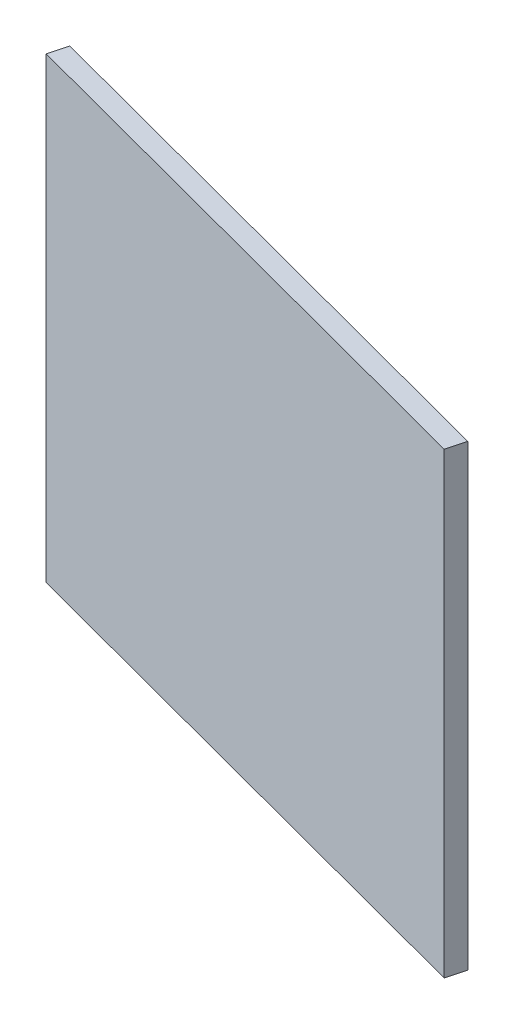
ISO-10303-21;
HEADER;
FILE_DESCRIPTION(('STEP AP214'),'2;1');
FILE_NAME('part.step','',(''),(''),'','','');
FILE_SCHEMA(('AUTOMOTIVE_DESIGN { 1 0 10303 214 1 1 1 1 }'));
ENDSEC;
DATA;
#1=APPLICATION_CONTEXT('core data for automotive mechanical design processes');
#2=APPLICATION_PROTOCOL_DEFINITION('international standard','automotive_design',2000,#1);
#3=PRODUCT_CONTEXT('',#1,'mechanical');
#4=PRODUCT('Part','Part','',(#3));
#5=PRODUCT_RELATED_PRODUCT_CATEGORY('part','',(#4));
#6=PRODUCT_DEFINITION_FORMATION('','',#4);
#7=PRODUCT_DEFINITION_CONTEXT('part definition',#1,'design');
#8=PRODUCT_DEFINITION('design','',#6,#7);
#9=PRODUCT_DEFINITION_SHAPE('','',#8);
#10=(LENGTH_UNIT() NAMED_UNIT(*) SI_UNIT(.MILLI.,.METRE.));
#11=(NAMED_UNIT(*) PLANE_ANGLE_UNIT() SI_UNIT($,.RADIAN.));
#12=(NAMED_UNIT(*) SI_UNIT($,.STERADIAN.) SOLID_ANGLE_UNIT());
#13=UNCERTAINTY_MEASURE_WITH_UNIT(LENGTH_MEASURE(1.E-05),#10,'distance_accuracy_value','');
#14=(GEOMETRIC_REPRESENTATION_CONTEXT(3) GLOBAL_UNCERTAINTY_ASSIGNED_CONTEXT((#13)) GLOBAL_UNIT_ASSIGNED_CONTEXT((#10,
#11,#12)) REPRESENTATION_CONTEXT('',''));
#15=CARTESIAN_POINT('',(0.,0.,0.));
#16=DIRECTION('',(0.,0.,1.));
#17=DIRECTION('',(1.,0.,0.));
#18=AXIS2_PLACEMENT_3D('',#15,#16,#17);
#19=CARTESIAN_POINT('',(-131.417732242282,1651.30622572697,262.501839991322));
#20=DIRECTION('',(0.,1.,0.));
#21=DIRECTION('',(0.,0.,1.));
#22=AXIS2_PLACEMENT_3D('',#19,#20,#21);
#23=PLANE('',#22);
#24=DIRECTION('',(0.966673657079184,0.,0.256011797988212));
#25=VECTOR('',#24,1.);
#26=CARTESIAN_POINT('',(-129.196631111449,1651.30622572697,254.115195431355));
#27=LINE('',#26,#25);
#28=CARTESIAN_POINT('',(-129.196631111449,1651.30622572697,254.115195431355));
#29=VERTEX_POINT('',#28);
#30=CARTESIAN_POINT('',(114.734622810417,1651.30622572697,318.717430575268));
#31=VERTEX_POINT('',#30);
#32=EDGE_CURVE('E79',#29,#31,#27,.T.);
#33=ORIENTED_EDGE('',*,*,#32,.F.);
#34=DIRECTION('',(0.256011797988212,0.,-0.966673657079184));
#35=VECTOR('',#34,1.);
#36=CARTESIAN_POINT('',(-131.417732242282,1651.30622572697,262.501839991322));
#37=LINE('',#36,#35);
#38=CARTESIAN_POINT('',(-131.417732242282,1651.30622572697,262.501839991322));
#39=VERTEX_POINT('',#38);
#40=EDGE_CURVE('E32',#39,#29,#37,.T.);
#41=ORIENTED_EDGE('',*,*,#40,.F.);
#42=DIRECTION('',(0.966673657079184,0.,0.256011797988212));
#43=VECTOR('',#42,1.);
#44=CARTESIAN_POINT('',(-131.417732242282,1651.30622572697,262.501839991322));
#45=LINE('',#44,#43);
#46=CARTESIAN_POINT('',(112.513521679583,1651.30622572697,327.104075135235));
#47=VERTEX_POINT('',#46);
#48=EDGE_CURVE('E71',#39,#47,#45,.T.);
#49=ORIENTED_EDGE('',*,*,#48,.T.);
#50=DIRECTION('',(0.256011797988212,0.,-0.966673657079184));
#51=VECTOR('',#50,1.);
#52=CARTESIAN_POINT('',(112.513521679583,1651.30622572697,327.104075135235));
#53=LINE('',#52,#51);
#54=EDGE_CURVE('E10',#47,#31,#53,.T.);
#55=ORIENTED_EDGE('',*,*,#54,.T.);
#56=EDGE_LOOP('',(#33,#41,#49,#55));
#57=FACE_BOUND('',#56,.T.);
#58=ADVANCED_FACE('F16',(#57),#23,.T.);
#59=CARTESIAN_POINT('',(112.513521679583,1651.30622572697,327.104075135235));
#60=DIRECTION('',(0.966673657079184,0.,0.256011797988212));
#61=DIRECTION('',(0.256011797988212,0.,-0.966673657079184));
#62=AXIS2_PLACEMENT_3D('',#59,#60,#61);
#63=PLANE('',#62);
#64=DIRECTION('',(0.,-1.,0.));
#65=VECTOR('',#64,1.);
#66=CARTESIAN_POINT('',(114.734622810417,1651.30622572697,318.717430575268));
#67=LINE('',#66,#65);
#68=CARTESIAN_POINT('',(114.734622810417,1444.96537404916,318.717430575268));
#69=VERTEX_POINT('',#68);
#70=EDGE_CURVE('E82',#31,#69,#67,.T.);
#71=ORIENTED_EDGE('',*,*,#70,.F.);
#72=ORIENTED_EDGE('',*,*,#54,.F.);
#73=DIRECTION('',(0.,-1.,0.));
#74=VECTOR('',#73,1.);
#75=CARTESIAN_POINT('',(112.513521679583,1651.30622572697,327.104075135235));
#76=LINE('',#75,#74);
#77=CARTESIAN_POINT('',(112.513521679584,1444.96537404916,327.104075135235));
#78=VERTEX_POINT('',#77);
#79=EDGE_CURVE('E67',#47,#78,#76,.T.);
#80=ORIENTED_EDGE('',*,*,#79,.T.);
#81=DIRECTION('',(0.256011797988212,0.,-0.966673657079184));
#82=VECTOR('',#81,1.);
#83=CARTESIAN_POINT('',(112.513521679584,1444.96537404916,327.104075135235));
#84=LINE('',#83,#82);
#85=EDGE_CURVE('E24',#78,#69,#84,.T.);
#86=ORIENTED_EDGE('',*,*,#85,.T.);
#87=EDGE_LOOP('',(#71,#72,#80,#86));
#88=FACE_BOUND('',#87,.T.);
#89=ADVANCED_FACE('F68',(#88),#63,.T.);
#90=CARTESIAN_POINT('',(112.513521679584,1444.96537404916,327.104075135235));
#91=DIRECTION('',(0.,-1.,0.));
#92=DIRECTION('',(0.,0.,-1.));
#93=AXIS2_PLACEMENT_3D('',#90,#91,#92);
#94=PLANE('',#93);
#95=DIRECTION('',(-0.966673657079184,0.,-0.256011797988212));
#96=VECTOR('',#95,1.);
#97=CARTESIAN_POINT('',(114.734622810417,1444.96537404916,318.717430575268));
#98=LINE('',#97,#96);
#99=CARTESIAN_POINT('',(-129.196631111449,1444.96537404916,254.115195431355));
#100=VERTEX_POINT('',#99);
#101=EDGE_CURVE('E65',#69,#100,#98,.T.);
#102=ORIENTED_EDGE('',*,*,#101,.F.);
#103=ORIENTED_EDGE('',*,*,#85,.F.);
#104=DIRECTION('',(-0.966673657079184,0.,-0.256011797988212));
#105=VECTOR('',#104,1.);
#106=CARTESIAN_POINT('',(112.513521679584,1444.96537404916,327.104075135235));
#107=LINE('',#106,#105);
#108=CARTESIAN_POINT('',(-131.417732242282,1444.96537404916,262.501839991322));
#109=VERTEX_POINT('',#108);
#110=EDGE_CURVE('E62',#78,#109,#107,.T.);
#111=ORIENTED_EDGE('',*,*,#110,.T.);
#112=DIRECTION('',(0.256011797988212,0.,-0.966673657079184));
#113=VECTOR('',#112,1.);
#114=CARTESIAN_POINT('',(-131.417732242282,1444.96537404916,262.501839991322));
#115=LINE('',#114,#113);
#116=EDGE_CURVE('E48',#109,#100,#115,.T.);
#117=ORIENTED_EDGE('',*,*,#116,.T.);
#118=EDGE_LOOP('',(#102,#103,#111,#117));
#119=FACE_BOUND('',#118,.T.);
#120=ADVANCED_FACE('F60',(#119),#94,.T.);
#121=CARTESIAN_POINT('',(-131.417732242282,1444.96537404916,262.501839991322));
#122=DIRECTION('',(-0.966673657079184,0.,-0.256011797988212));
#123=DIRECTION('',(-0.256011797988212,0.,0.966673657079184));
#124=AXIS2_PLACEMENT_3D('',#121,#122,#123);
#125=PLANE('',#124);
#126=DIRECTION('',(0.,1.,0.));
#127=VECTOR('',#126,1.);
#128=CARTESIAN_POINT('',(-129.196631111449,1444.96537404916,254.115195431355));
#129=LINE('',#128,#127);
#130=EDGE_CURVE('E85',#100,#29,#129,.T.);
#131=ORIENTED_EDGE('',*,*,#130,.F.);
#132=ORIENTED_EDGE('',*,*,#116,.F.);
#133=DIRECTION('',(0.,1.,0.));
#134=VECTOR('',#133,1.);
#135=CARTESIAN_POINT('',(-131.417732242282,1444.96537404916,262.501839991322));
#136=LINE('',#135,#134);
#137=EDGE_CURVE('E74',#109,#39,#136,.T.);
#138=ORIENTED_EDGE('',*,*,#137,.T.);
#139=ORIENTED_EDGE('',*,*,#40,.T.);
#140=EDGE_LOOP('',(#131,#132,#138,#139));
#141=FACE_BOUND('',#140,.T.);
#142=ADVANCED_FACE('F96',(#141),#125,.T.);
#143=CARTESIAN_POINT('',(-129.319638759168,1548.13579988807,263.05749461274));
#144=DIRECTION('',(0.256011797988212,0.,-0.966673657079184));
#145=DIRECTION('',(0.,1.,0.));
#146=AXIS2_PLACEMENT_3D('',#143,#144,#145);
#147=PLANE('',#146);
#148=ORIENTED_EDGE('',*,*,#48,.F.);
#149=ORIENTED_EDGE('',*,*,#137,.F.);
#150=ORIENTED_EDGE('',*,*,#110,.F.);
#151=ORIENTED_EDGE('',*,*,#79,.F.);
#152=EDGE_LOOP('',(#148,#149,#150,#151));
#153=FACE_BOUND('',#152,.T.);
#154=ADVANCED_FACE('F73',(#153),#147,.F.);
#155=CARTESIAN_POINT('',(-127.098537628335,1548.13579988807,254.670850052773));
#156=DIRECTION('',(0.256011797988212,0.,-0.966673657079184));
#157=DIRECTION('',(0.,1.,0.));
#158=AXIS2_PLACEMENT_3D('',#155,#156,#157);
#159=PLANE('',#158);
#160=ORIENTED_EDGE('',*,*,#32,.T.);
#161=ORIENTED_EDGE('',*,*,#70,.T.);
#162=ORIENTED_EDGE('',*,*,#101,.T.);
#163=ORIENTED_EDGE('',*,*,#130,.T.);
#164=EDGE_LOOP('',(#160,#161,#162,#163));
#165=FACE_BOUND('',#164,.T.);
#166=ADVANCED_FACE('F89',(#165),#159,.T.);
#167=CLOSED_SHELL('',(#58,#89,#120,#142,#154,#166));
#168=MANIFOLD_SOLID_BREP('B1',#167);
#169=ADVANCED_BREP_SHAPE_REPRESENTATION('',(#18,#168),#14);
#170=SHAPE_DEFINITION_REPRESENTATION(#9,#169);
ENDSEC;
END-ISO-10303-21;
